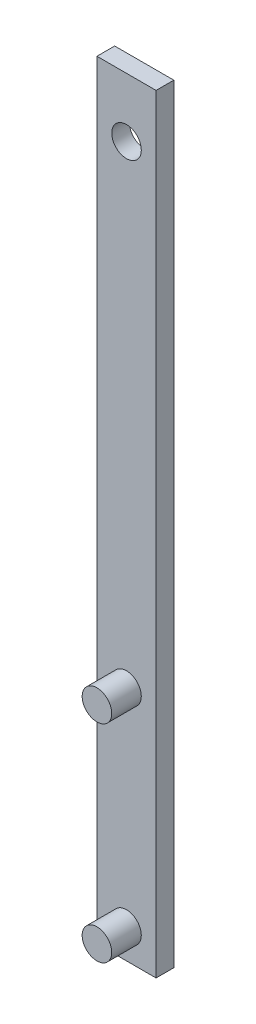
ISO-10303-21;
HEADER;
FILE_DESCRIPTION(('STEP AP214'),'2;1');
FILE_NAME('part.step','',(''),(''),'','','');
FILE_SCHEMA(('AUTOMOTIVE_DESIGN { 1 0 10303 214 1 1 1 1 }'));
ENDSEC;
DATA;
#1=APPLICATION_CONTEXT('core data for automotive mechanical design processes');
#2=APPLICATION_PROTOCOL_DEFINITION('international standard','automotive_design',2000,#1);
#3=PRODUCT_CONTEXT('',#1,'mechanical');
#4=PRODUCT('Part','Part','',(#3));
#5=PRODUCT_RELATED_PRODUCT_CATEGORY('part','',(#4));
#6=PRODUCT_DEFINITION_FORMATION('','',#4);
#7=PRODUCT_DEFINITION_CONTEXT('part definition',#1,'design');
#8=PRODUCT_DEFINITION('design','',#6,#7);
#9=PRODUCT_DEFINITION_SHAPE('','',#8);
#10=(LENGTH_UNIT() NAMED_UNIT(*) SI_UNIT(.MILLI.,.METRE.));
#11=(NAMED_UNIT(*) PLANE_ANGLE_UNIT() SI_UNIT($,.RADIAN.));
#12=(NAMED_UNIT(*) SI_UNIT($,.STERADIAN.) SOLID_ANGLE_UNIT());
#13=UNCERTAINTY_MEASURE_WITH_UNIT(LENGTH_MEASURE(1.E-05),#10,'distance_accuracy_value','');
#14=(GEOMETRIC_REPRESENTATION_CONTEXT(3) GLOBAL_UNCERTAINTY_ASSIGNED_CONTEXT((#13)) GLOBAL_UNIT_ASSIGNED_CONTEXT((#10,
#11,#12)) REPRESENTATION_CONTEXT('',''));
#15=CARTESIAN_POINT('',(0.,0.,0.));
#16=DIRECTION('',(0.,0.,1.));
#17=DIRECTION('',(1.,0.,0.));
#18=AXIS2_PLACEMENT_3D('',#15,#16,#17);
#19=CARTESIAN_POINT('',(0.,0.,3.));
#20=DIRECTION('',(0.,0.,1.));
#21=DIRECTION('',(1.,0.,0.));
#22=AXIS2_PLACEMENT_3D('',#19,#20,#21);
#23=PLANE('',#22);
#24=CARTESIAN_POINT('',(0.,-60.,3.));
#25=DIRECTION('',(0.,0.,1.));
#26=DIRECTION('',(1.,0.,0.));
#27=AXIS2_PLACEMENT_3D('',#24,#25,#26);
#28=CIRCLE('',#27,2.5);
#29=CARTESIAN_POINT('',(2.5,-60.,3.));
#30=VERTEX_POINT('',#29);
#31=EDGE_CURVE('E207',#30,#30,#28,.T.);
#32=ORIENTED_EDGE('',*,*,#31,.F.);
#33=EDGE_LOOP('',(#32));
#34=FACE_BOUND('',#33,.T.);
#35=DIRECTION('',(1.,0.,0.));
#36=VECTOR('',#35,1.);
#37=CARTESIAN_POINT('',(-5.,65.,3.));
#38=LINE('',#37,#36);
#39=CARTESIAN_POINT('',(-5.,65.,3.));
#40=VERTEX_POINT('',#39);
#41=CARTESIAN_POINT('',(5.,65.,3.));
#42=VERTEX_POINT('',#41);
#43=EDGE_CURVE('E137',#40,#42,#38,.T.);
#44=ORIENTED_EDGE('',*,*,#43,.F.);
#45=DIRECTION('',(0.,1.,0.));
#46=VECTOR('',#45,1.);
#47=CARTESIAN_POINT('',(-5.,-65.,3.));
#48=LINE('',#47,#46);
#49=CARTESIAN_POINT('',(-5.,-65.,3.));
#50=VERTEX_POINT('',#49);
#51=EDGE_CURVE('E127',#50,#40,#48,.T.);
#52=ORIENTED_EDGE('',*,*,#51,.F.);
#53=DIRECTION('',(1.,0.,0.));
#54=VECTOR('',#53,1.);
#55=CARTESIAN_POINT('',(-5.,-65.,3.));
#56=LINE('',#55,#54);
#57=CARTESIAN_POINT('',(5.,-65.,3.));
#58=VERTEX_POINT('',#57);
#59=EDGE_CURVE('E124',#50,#58,#56,.T.);
#60=ORIENTED_EDGE('',*,*,#59,.T.);
#61=DIRECTION('',(0.,1.,0.));
#62=VECTOR('',#61,1.);
#63=CARTESIAN_POINT('',(5.,-65.,3.));
#64=LINE('',#63,#62);
#65=EDGE_CURVE('E121',#58,#42,#64,.T.);
#66=ORIENTED_EDGE('',*,*,#65,.T.);
#67=EDGE_LOOP('',(#44,#52,#60,#66));
#68=FACE_BOUND('',#67,.T.);
#69=CARTESIAN_POINT('',(0.,-25.,3.));
#70=DIRECTION('',(0.,0.,1.));
#71=DIRECTION('',(1.,0.,0.));
#72=AXIS2_PLACEMENT_3D('',#69,#70,#71);
#73=CIRCLE('',#72,2.5);
#74=CARTESIAN_POINT('',(2.5,-25.,3.));
#75=VERTEX_POINT('',#74);
#76=EDGE_CURVE('E148',#75,#75,#73,.T.);
#77=ORIENTED_EDGE('',*,*,#76,.F.);
#78=EDGE_LOOP('',(#77));
#79=FACE_BOUND('',#78,.T.);
#80=CARTESIAN_POINT('',(0.,55.,3.));
#81=DIRECTION('',(0.,0.,1.));
#82=DIRECTION('',(1.,0.,0.));
#83=AXIS2_PLACEMENT_3D('',#80,#81,#82);
#84=CIRCLE('',#83,2.5);
#85=CARTESIAN_POINT('',(2.5,55.,3.));
#86=VERTEX_POINT('',#85);
#87=EDGE_CURVE('E204',#86,#86,#84,.T.);
#88=ORIENTED_EDGE('',*,*,#87,.F.);
#89=EDGE_LOOP('',(#88));
#90=FACE_BOUND('',#89,.T.);
#91=ADVANCED_FACE('F78',(#34,#68,#79,#90),#23,.T.);
#92=CARTESIAN_POINT('',(0.,0.,0.));
#93=DIRECTION('',(0.,0.,1.));
#94=DIRECTION('',(1.,0.,0.));
#95=AXIS2_PLACEMENT_3D('',#92,#93,#94);
#96=PLANE('',#95);
#97=DIRECTION('',(1.,0.,0.));
#98=VECTOR('',#97,1.);
#99=CARTESIAN_POINT('',(-5.,65.,0.));
#100=LINE('',#99,#98);
#101=CARTESIAN_POINT('',(-5.,65.,0.));
#102=VERTEX_POINT('',#101);
#103=CARTESIAN_POINT('',(5.,65.,0.));
#104=VERTEX_POINT('',#103);
#105=EDGE_CURVE('E144',#102,#104,#100,.T.);
#106=ORIENTED_EDGE('',*,*,#105,.T.);
#107=DIRECTION('',(0.,1.,0.));
#108=VECTOR('',#107,1.);
#109=CARTESIAN_POINT('',(5.,-65.,0.));
#110=LINE('',#109,#108);
#111=CARTESIAN_POINT('',(5.,-65.,0.));
#112=VERTEX_POINT('',#111);
#113=EDGE_CURVE('E147',#112,#104,#110,.T.);
#114=ORIENTED_EDGE('',*,*,#113,.F.);
#115=DIRECTION('',(1.,0.,0.));
#116=VECTOR('',#115,1.);
#117=CARTESIAN_POINT('',(-5.,-65.,0.));
#118=LINE('',#117,#116);
#119=CARTESIAN_POINT('',(-5.,-65.,0.));
#120=VERTEX_POINT('',#119);
#121=EDGE_CURVE('E132',#120,#112,#118,.T.);
#122=ORIENTED_EDGE('',*,*,#121,.F.);
#123=DIRECTION('',(0.,1.,0.));
#124=VECTOR('',#123,1.);
#125=CARTESIAN_POINT('',(-5.,-65.,0.));
#126=LINE('',#125,#124);
#127=EDGE_CURVE('E139',#120,#102,#126,.T.);
#128=ORIENTED_EDGE('',*,*,#127,.T.);
#129=EDGE_LOOP('',(#106,#114,#122,#128));
#130=FACE_BOUND('',#129,.T.);
#131=CARTESIAN_POINT('',(0.,55.,0.));
#132=DIRECTION('',(0.,0.,1.));
#133=DIRECTION('',(1.,0.,0.));
#134=AXIS2_PLACEMENT_3D('',#131,#132,#133);
#135=CIRCLE('',#134,2.5);
#136=CARTESIAN_POINT('',(2.5,55.,0.));
#137=VERTEX_POINT('',#136);
#138=EDGE_CURVE('E201',#137,#137,#135,.T.);
#139=ORIENTED_EDGE('',*,*,#138,.T.);
#140=EDGE_LOOP('',(#139));
#141=FACE_BOUND('',#140,.T.);
#142=ADVANCED_FACE('F154',(#130,#141),#96,.F.);
#143=CARTESIAN_POINT('',(-5.,65.,3.));
#144=DIRECTION('',(0.,1.,0.));
#145=DIRECTION('',(0.,0.,1.));
#146=AXIS2_PLACEMENT_3D('',#143,#144,#145);
#147=PLANE('',#146);
#148=ORIENTED_EDGE('',*,*,#105,.F.);
#149=DIRECTION('',(0.,0.,-1.));
#150=VECTOR('',#149,1.);
#151=CARTESIAN_POINT('',(-5.,65.,3.));
#152=LINE('',#151,#150);
#153=EDGE_CURVE('E12',#40,#102,#152,.T.);
#154=ORIENTED_EDGE('',*,*,#153,.F.);
#155=ORIENTED_EDGE('',*,*,#43,.T.);
#156=DIRECTION('',(0.,0.,-1.));
#157=VECTOR('',#156,1.);
#158=CARTESIAN_POINT('',(5.,65.,3.));
#159=LINE('',#158,#157);
#160=EDGE_CURVE('E82',#42,#104,#159,.T.);
#161=ORIENTED_EDGE('',*,*,#160,.T.);
#162=EDGE_LOOP('',(#148,#154,#155,#161));
#163=FACE_BOUND('',#162,.T.);
#164=ADVANCED_FACE('F80',(#163),#147,.T.);
#165=CARTESIAN_POINT('',(-5.,-65.,3.));
#166=DIRECTION('',(-1.,0.,0.));
#167=DIRECTION('',(0.,0.,1.));
#168=AXIS2_PLACEMENT_3D('',#165,#166,#167);
#169=PLANE('',#168);
#170=ORIENTED_EDGE('',*,*,#127,.F.);
#171=DIRECTION('',(0.,0.,-1.));
#172=VECTOR('',#171,1.);
#173=CARTESIAN_POINT('',(-5.,-65.,3.));
#174=LINE('',#173,#172);
#175=EDGE_CURVE('E88',#50,#120,#174,.T.);
#176=ORIENTED_EDGE('',*,*,#175,.F.);
#177=ORIENTED_EDGE('',*,*,#51,.T.);
#178=ORIENTED_EDGE('',*,*,#153,.T.);
#179=EDGE_LOOP('',(#170,#176,#177,#178));
#180=FACE_BOUND('',#179,.T.);
#181=ADVANCED_FACE('F156',(#180),#169,.T.);
#182=CARTESIAN_POINT('',(-5.,-65.,3.));
#183=DIRECTION('',(0.,1.,0.));
#184=DIRECTION('',(0.,0.,1.));
#185=AXIS2_PLACEMENT_3D('',#182,#183,#184);
#186=PLANE('',#185);
#187=ORIENTED_EDGE('',*,*,#121,.T.);
#188=DIRECTION('',(0.,0.,-1.));
#189=VECTOR('',#188,1.);
#190=CARTESIAN_POINT('',(5.,-65.,3.));
#191=LINE('',#190,#189);
#192=EDGE_CURVE('E130',#58,#112,#191,.T.);
#193=ORIENTED_EDGE('',*,*,#192,.F.);
#194=ORIENTED_EDGE('',*,*,#59,.F.);
#195=ORIENTED_EDGE('',*,*,#175,.T.);
#196=EDGE_LOOP('',(#187,#193,#194,#195));
#197=FACE_BOUND('',#196,.T.);
#198=ADVANCED_FACE('F131',(#197),#186,.F.);
#199=CARTESIAN_POINT('',(5.,-65.,3.));
#200=DIRECTION('',(-1.,0.,0.));
#201=DIRECTION('',(0.,0.,1.));
#202=AXIS2_PLACEMENT_3D('',#199,#200,#201);
#203=PLANE('',#202);
#204=ORIENTED_EDGE('',*,*,#113,.T.);
#205=ORIENTED_EDGE('',*,*,#160,.F.);
#206=ORIENTED_EDGE('',*,*,#65,.F.);
#207=ORIENTED_EDGE('',*,*,#192,.T.);
#208=EDGE_LOOP('',(#204,#205,#206,#207));
#209=FACE_BOUND('',#208,.T.);
#210=ADVANCED_FACE('F136',(#209),#203,.F.);
#211=CARTESIAN_POINT('',(0.,55.,3.));
#212=DIRECTION('',(0.,0.,-1.));
#213=DIRECTION('',(-1.,0.,0.));
#214=AXIS2_PLACEMENT_3D('',#211,#212,#213);
#215=CYLINDRICAL_SURFACE('',#214,2.5);
#216=ORIENTED_EDGE('',*,*,#87,.T.);
#217=EDGE_LOOP('',(#216));
#218=FACE_BOUND('',#217,.T.);
#219=ORIENTED_EDGE('',*,*,#138,.F.);
#220=EDGE_LOOP('',(#219));
#221=FACE_BOUND('',#220,.T.);
#222=ADVANCED_FACE('F173',(#218,#221),#215,.F.);
#223=CARTESIAN_POINT('',(0.,-25.,8.));
#224=DIRECTION('',(0.,0.,-1.));
#225=DIRECTION('',(-1.,0.,0.));
#226=AXIS2_PLACEMENT_3D('',#223,#224,#225);
#227=CYLINDRICAL_SURFACE('',#226,2.5);
#228=ORIENTED_EDGE('',*,*,#76,.T.);
#229=EDGE_LOOP('',(#228));
#230=FACE_BOUND('',#229,.T.);
#231=CARTESIAN_POINT('',(0.,-25.,8.));
#232=DIRECTION('',(0.,0.,1.));
#233=DIRECTION('',(1.,0.,0.));
#234=AXIS2_PLACEMENT_3D('',#231,#232,#233);
#235=CIRCLE('',#234,2.5);
#236=CARTESIAN_POINT('',(2.5,-25.,8.));
#237=VERTEX_POINT('',#236);
#238=EDGE_CURVE('E198',#237,#237,#235,.T.);
#239=ORIENTED_EDGE('',*,*,#238,.F.);
#240=EDGE_LOOP('',(#239));
#241=FACE_BOUND('',#240,.T.);
#242=ADVANCED_FACE('F176',(#230,#241),#227,.T.);
#243=CARTESIAN_POINT('',(0.,0.,8.));
#244=DIRECTION('',(0.,0.,1.));
#245=DIRECTION('',(1.,0.,0.));
#246=AXIS2_PLACEMENT_3D('',#243,#244,#245);
#247=PLANE('',#246);
#248=ORIENTED_EDGE('',*,*,#238,.T.);
#249=EDGE_LOOP('',(#248));
#250=FACE_BOUND('',#249,.T.);
#251=ADVANCED_FACE('F180',(#250),#247,.T.);
#252=CARTESIAN_POINT('',(0.,-60.,8.));
#253=DIRECTION('',(0.,0.,-1.));
#254=DIRECTION('',(-1.,0.,0.));
#255=AXIS2_PLACEMENT_3D('',#252,#253,#254);
#256=CYLINDRICAL_SURFACE('',#255,2.5);
#257=ORIENTED_EDGE('',*,*,#31,.T.);
#258=EDGE_LOOP('',(#257));
#259=FACE_BOUND('',#258,.T.);
#260=CARTESIAN_POINT('',(0.,-60.,8.));
#261=DIRECTION('',(0.,0.,1.));
#262=DIRECTION('',(1.,0.,0.));
#263=AXIS2_PLACEMENT_3D('',#260,#261,#262);
#264=CIRCLE('',#263,2.5);
#265=CARTESIAN_POINT('',(2.5,-60.,8.));
#266=VERTEX_POINT('',#265);
#267=EDGE_CURVE('E196',#266,#266,#264,.T.);
#268=ORIENTED_EDGE('',*,*,#267,.F.);
#269=EDGE_LOOP('',(#268));
#270=FACE_BOUND('',#269,.T.);
#271=ADVANCED_FACE('F184',(#259,#270),#256,.T.);
#272=CARTESIAN_POINT('',(0.,0.,8.));
#273=DIRECTION('',(0.,0.,1.));
#274=DIRECTION('',(1.,0.,0.));
#275=AXIS2_PLACEMENT_3D('',#272,#273,#274);
#276=PLANE('',#275);
#277=ORIENTED_EDGE('',*,*,#267,.T.);
#278=EDGE_LOOP('',(#277));
#279=FACE_BOUND('',#278,.T.);
#280=ADVANCED_FACE('F188',(#279),#276,.T.);
#281=CLOSED_SHELL('',(#91,#142,#164,#181,#198,#210,#222,#242,#251,#271,#280));
#282=MANIFOLD_SOLID_BREP('B2',#281);
#283=ADVANCED_BREP_SHAPE_REPRESENTATION('',(#18,#282),#14);
#284=SHAPE_DEFINITION_REPRESENTATION(#9,#283);
ENDSEC;
END-ISO-10303-21;
